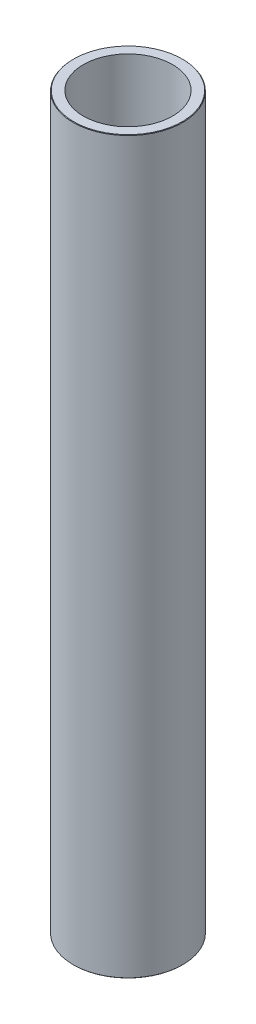
ISO-10303-21;
HEADER;
FILE_DESCRIPTION(('STEP AP214'),'2;1');
FILE_NAME('part.step','',(''),(''),'','','');
FILE_SCHEMA(('AUTOMOTIVE_DESIGN { 1 0 10303 214 1 1 1 1 }'));
ENDSEC;
DATA;
#1=APPLICATION_CONTEXT('core data for automotive mechanical design processes');
#2=APPLICATION_PROTOCOL_DEFINITION('international standard','automotive_design',2000,#1);
#3=PRODUCT_CONTEXT('',#1,'mechanical');
#4=PRODUCT('Part','Part','',(#3));
#5=PRODUCT_RELATED_PRODUCT_CATEGORY('part','',(#4));
#6=PRODUCT_DEFINITION_FORMATION('','',#4);
#7=PRODUCT_DEFINITION_CONTEXT('part definition',#1,'design');
#8=PRODUCT_DEFINITION('design','',#6,#7);
#9=PRODUCT_DEFINITION_SHAPE('','',#8);
#10=(LENGTH_UNIT() NAMED_UNIT(*) SI_UNIT(.MILLI.,.METRE.));
#11=(NAMED_UNIT(*) PLANE_ANGLE_UNIT() SI_UNIT($,.RADIAN.));
#12=(NAMED_UNIT(*) SI_UNIT($,.STERADIAN.) SOLID_ANGLE_UNIT());
#13=UNCERTAINTY_MEASURE_WITH_UNIT(LENGTH_MEASURE(1.E-05),#10,'distance_accuracy_value','');
#14=(GEOMETRIC_REPRESENTATION_CONTEXT(3) GLOBAL_UNCERTAINTY_ASSIGNED_CONTEXT((#13)) GLOBAL_UNIT_ASSIGNED_CONTEXT((#10,
#11,#12)) REPRESENTATION_CONTEXT('',''));
#15=CARTESIAN_POINT('',(0.,0.,0.));
#16=DIRECTION('',(0.,0.,1.));
#17=DIRECTION('',(1.,0.,0.));
#18=AXIS2_PLACEMENT_3D('',#15,#16,#17);
#19=CARTESIAN_POINT('',(0.,600.,0.));
#20=DIRECTION('',(0.,-1.,0.));
#21=DIRECTION('',(0.,0.,-1.));
#22=AXIS2_PLACEMENT_3D('',#19,#20,#21);
#23=CYLINDRICAL_SURFACE('',#22,45.);
#24=CARTESIAN_POINT('',(0.,599.605536491023,0.));
#25=DIRECTION('',(0.,1.,0.));
#26=DIRECTION('',(0.,0.,1.));
#27=AXIS2_PLACEMENT_3D('',#24,#25,#26);
#28=CIRCLE('',#27,45.);
#29=CARTESIAN_POINT('',(0.,599.605536491023,45.));
#30=VERTEX_POINT('',#29);
#31=EDGE_CURVE('E50',#30,#30,#28,.F.);
#32=ORIENTED_EDGE('',*,*,#31,.T.);
#33=EDGE_LOOP('',(#32));
#34=FACE_BOUND('',#33,.T.);
#35=CARTESIAN_POINT('',(0.,0.394463508977538,0.));
#36=DIRECTION('',(0.,1.,0.));
#37=DIRECTION('',(0.,0.,1.));
#38=AXIS2_PLACEMENT_3D('',#35,#36,#37);
#39=CIRCLE('',#38,45.);
#40=CARTESIAN_POINT('',(0.,0.394463508977538,45.));
#41=VERTEX_POINT('',#40);
#42=EDGE_CURVE('E51',#41,#41,#39,.T.);
#43=ORIENTED_EDGE('',*,*,#42,.T.);
#44=EDGE_LOOP('',(#43));
#45=FACE_BOUND('',#44,.T.);
#46=ADVANCED_FACE('F39',(#34,#45),#23,.T.);
#47=CARTESIAN_POINT('',(0.,600.,0.));
#48=DIRECTION('',(0.,1.,0.));
#49=DIRECTION('',(0.,0.,1.));
#50=AXIS2_PLACEMENT_3D('',#47,#48,#49);
#51=PLANE('',#50);
#52=CARTESIAN_POINT('',(0.,600.,0.));
#53=DIRECTION('',(0.,1.,0.));
#54=DIRECTION('',(0.,0.,1.));
#55=AXIS2_PLACEMENT_3D('',#52,#53,#54);
#56=CIRCLE('',#55,44.6055364910226);
#57=CARTESIAN_POINT('',(0.,600.,44.6055364910226));
#58=VERTEX_POINT('',#57);
#59=EDGE_CURVE('E54',#58,#58,#56,.T.);
#60=ORIENTED_EDGE('',*,*,#59,.T.);
#61=EDGE_LOOP('',(#60));
#62=FACE_BOUND('',#61,.T.);
#63=CARTESIAN_POINT('',(0.,600.,0.));
#64=DIRECTION('',(0.,1.,0.));
#65=DIRECTION('',(0.,0.,1.));
#66=AXIS2_PLACEMENT_3D('',#63,#64,#65);
#67=CIRCLE('',#66,36.6763499940579);
#68=CARTESIAN_POINT('',(0.,600.,36.6763499940579));
#69=VERTEX_POINT('',#68);
#70=EDGE_CURVE('E58',#69,#69,#67,.T.);
#71=ORIENTED_EDGE('',*,*,#70,.F.);
#72=EDGE_LOOP('',(#71));
#73=FACE_BOUND('',#72,.T.);
#74=ADVANCED_FACE('F69',(#62,#73),#51,.T.);
#75=CARTESIAN_POINT('',(0.,0.,0.));
#76=DIRECTION('',(0.,1.,0.));
#77=DIRECTION('',(0.,0.,1.));
#78=AXIS2_PLACEMENT_3D('',#75,#76,#77);
#79=PLANE('',#78);
#80=CARTESIAN_POINT('',(0.,0.,0.));
#81=DIRECTION('',(0.,1.,0.));
#82=DIRECTION('',(0.,0.,1.));
#83=AXIS2_PLACEMENT_3D('',#80,#81,#82);
#84=CIRCLE('',#83,44.6055364910225);
#85=CARTESIAN_POINT('',(0.,0.,44.6055364910225));
#86=VERTEX_POINT('',#85);
#87=EDGE_CURVE('E10',#86,#86,#84,.F.);
#88=ORIENTED_EDGE('',*,*,#87,.T.);
#89=EDGE_LOOP('',(#88));
#90=FACE_BOUND('',#89,.T.);
#91=CARTESIAN_POINT('',(0.,0.,0.));
#92=DIRECTION('',(0.,1.,0.));
#93=DIRECTION('',(0.,0.,1.));
#94=AXIS2_PLACEMENT_3D('',#91,#92,#93);
#95=CIRCLE('',#94,36.6763499940579);
#96=CARTESIAN_POINT('',(0.,0.,36.6763499940579));
#97=VERTEX_POINT('',#96);
#98=EDGE_CURVE('E63',#97,#97,#95,.T.);
#99=ORIENTED_EDGE('',*,*,#98,.T.);
#100=EDGE_LOOP('',(#99));
#101=FACE_BOUND('',#100,.T.);
#102=ADVANCED_FACE('F75',(#90,#101),#79,.F.);
#103=CARTESIAN_POINT('',(0.,600.,0.));
#104=DIRECTION('',(0.,-1.,0.));
#105=DIRECTION('',(0.,0.,-1.));
#106=AXIS2_PLACEMENT_3D('',#103,#104,#105);
#107=CYLINDRICAL_SURFACE('',#106,36.6763499940579);
#108=ORIENTED_EDGE('',*,*,#70,.T.);
#109=EDGE_LOOP('',(#108));
#110=FACE_BOUND('',#109,.T.);
#111=ORIENTED_EDGE('',*,*,#98,.F.);
#112=EDGE_LOOP('',(#111));
#113=FACE_BOUND('',#112,.T.);
#114=ADVANCED_FACE('F70',(#110,#113),#107,.F.);
#115=CARTESIAN_POINT('',(0.,600.,0.));
#116=DIRECTION('',(0.,-1.,0.));
#117=DIRECTION('',(0.,0.,-1.));
#118=AXIS2_PLACEMENT_3D('',#115,#116,#117);
#119=CONICAL_SURFACE('',#118,44.6055364910226,0.785398163397545);
#120=ORIENTED_EDGE('',*,*,#31,.F.);
#121=EDGE_LOOP('',(#120));
#122=FACE_BOUND('',#121,.T.);
#123=ORIENTED_EDGE('',*,*,#59,.F.);
#124=EDGE_LOOP('',(#123));
#125=FACE_BOUND('',#124,.T.);
#126=ADVANCED_FACE('F81',(#122,#125),#119,.T.);
#127=CARTESIAN_POINT('',(0.,0.394463508977538,0.));
#128=DIRECTION('',(0.,1.,0.));
#129=DIRECTION('',(0.,0.,1.));
#130=AXIS2_PLACEMENT_3D('',#127,#128,#129);
#131=CONICAL_SURFACE('',#130,45.,0.785398163397413);
#132=ORIENTED_EDGE('',*,*,#87,.F.);
#133=EDGE_LOOP('',(#132));
#134=FACE_BOUND('',#133,.T.);
#135=ORIENTED_EDGE('',*,*,#42,.F.);
#136=EDGE_LOOP('',(#135));
#137=FACE_BOUND('',#136,.T.);
#138=ADVANCED_FACE('F45',(#134,#137),#131,.T.);
#139=CLOSED_SHELL('',(#46,#74,#102,#114,#126,#138));
#140=MANIFOLD_SOLID_BREP('B2',#139);
#141=ADVANCED_BREP_SHAPE_REPRESENTATION('',(#18,#140),#14);
#142=SHAPE_DEFINITION_REPRESENTATION(#9,#141);
ENDSEC;
END-ISO-10303-21;
